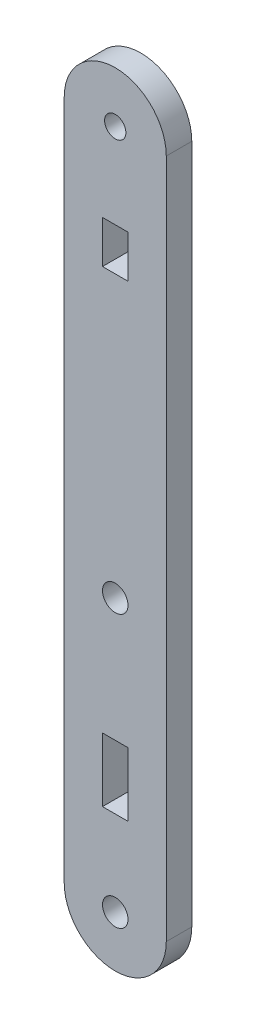
ISO-10303-21;
HEADER;
FILE_DESCRIPTION(('STEP AP214'),'2;1');
FILE_NAME('part.step','',(''),(''),'','','');
FILE_SCHEMA(('AUTOMOTIVE_DESIGN { 1 0 10303 214 1 1 1 1 }'));
ENDSEC;
DATA;
#1=APPLICATION_CONTEXT('core data for automotive mechanical design processes');
#2=APPLICATION_PROTOCOL_DEFINITION('international standard','automotive_design',2000,#1);
#3=PRODUCT_CONTEXT('',#1,'mechanical');
#4=PRODUCT('Part','Part','',(#3));
#5=PRODUCT_RELATED_PRODUCT_CATEGORY('part','',(#4));
#6=PRODUCT_DEFINITION_FORMATION('','',#4);
#7=PRODUCT_DEFINITION_CONTEXT('part definition',#1,'design');
#8=PRODUCT_DEFINITION('design','',#6,#7);
#9=PRODUCT_DEFINITION_SHAPE('','',#8);
#10=(LENGTH_UNIT() NAMED_UNIT(*) SI_UNIT(.MILLI.,.METRE.));
#11=(NAMED_UNIT(*) PLANE_ANGLE_UNIT() SI_UNIT($,.RADIAN.));
#12=(NAMED_UNIT(*) SI_UNIT($,.STERADIAN.) SOLID_ANGLE_UNIT());
#13=UNCERTAINTY_MEASURE_WITH_UNIT(LENGTH_MEASURE(1.E-05),#10,'distance_accuracy_value','');
#14=(GEOMETRIC_REPRESENTATION_CONTEXT(3) GLOBAL_UNCERTAINTY_ASSIGNED_CONTEXT((#13)) GLOBAL_UNIT_ASSIGNED_CONTEXT((#10,
#11,#12)) REPRESENTATION_CONTEXT('',''));
#15=CARTESIAN_POINT('',(0.,0.,0.));
#16=DIRECTION('',(0.,0.,1.));
#17=DIRECTION('',(1.,0.,0.));
#18=AXIS2_PLACEMENT_3D('',#15,#16,#17);
#19=CARTESIAN_POINT('',(2176.74034545701,1499.10024083383,3.));
#20=DIRECTION('',(0.,0.,1.));
#21=DIRECTION('',(1.,0.,0.));
#22=AXIS2_PLACEMENT_3D('',#19,#20,#21);
#23=PLANE('',#22);
#24=CARTESIAN_POINT('',(2176.74350350772,1499.10717013721,3.));
#25=DIRECTION('',(0.,0.,1.));
#26=DIRECTION('',(1.,0.,0.));
#27=AXIS2_PLACEMENT_3D('',#24,#25,#26);
#28=CIRCLE('',#27,1.50000000000011);
#29=CARTESIAN_POINT('',(2178.24350350772,1499.10717013721,3.));
#30=VERTEX_POINT('',#29);
#31=EDGE_CURVE('E169',#30,#30,#28,.T.);
#32=ORIENTED_EDGE('',*,*,#31,.F.);
#33=EDGE_LOOP('',(#32));
#34=FACE_BOUND('',#33,.T.);
#35=DIRECTION('',(0.,1.,0.));
#36=VECTOR('',#35,1.);
#37=CARTESIAN_POINT('',(2178.24034545616,1564.10018841039,3.));
#38=LINE('',#37,#36);
#39=CARTESIAN_POINT('',(2178.24034545616,1564.10018841039,3.));
#40=VERTEX_POINT('',#39);
#41=CARTESIAN_POINT('',(2178.24034545616,1569.10018841039,3.));
#42=VERTEX_POINT('',#41);
#43=EDGE_CURVE('E183',#40,#42,#38,.T.);
#44=ORIENTED_EDGE('',*,*,#43,.F.);
#45=DIRECTION('',(1.,0.,0.));
#46=VECTOR('',#45,1.);
#47=CARTESIAN_POINT('',(2175.24034545616,1564.10018841039,3.));
#48=LINE('',#47,#46);
#49=CARTESIAN_POINT('',(2175.24034545616,1564.10018841039,3.));
#50=VERTEX_POINT('',#49);
#51=EDGE_CURVE('E181',#50,#40,#48,.T.);
#52=ORIENTED_EDGE('',*,*,#51,.F.);
#53=DIRECTION('',(0.,-1.,0.));
#54=VECTOR('',#53,1.);
#55=CARTESIAN_POINT('',(2175.24034545616,1569.10018841039,3.));
#56=LINE('',#55,#54);
#57=CARTESIAN_POINT('',(2175.24034545616,1569.10018841039,3.));
#58=VERTEX_POINT('',#57);
#59=EDGE_CURVE('E189',#58,#50,#56,.T.);
#60=ORIENTED_EDGE('',*,*,#59,.F.);
#61=DIRECTION('',(-1.,0.,0.));
#62=VECTOR('',#61,1.);
#63=CARTESIAN_POINT('',(2178.24034545616,1569.10018841039,3.));
#64=LINE('',#63,#62);
#65=EDGE_CURVE('E186',#42,#58,#64,.T.);
#66=ORIENTED_EDGE('',*,*,#65,.F.);
#67=EDGE_LOOP('',(#44,#52,#60,#66));
#68=FACE_BOUND('',#67,.T.);
#69=DIRECTION('',(0.,1.,0.));
#70=VECTOR('',#69,1.);
#71=CARTESIAN_POINT('',(2182.74034545616,1561.71130395543,3.));
#72=LINE('',#71,#70);
#73=CARTESIAN_POINT('',(2182.74034545616,1499.1000884104,3.));
#74=VERTEX_POINT('',#73);
#75=CARTESIAN_POINT('',(2182.74034545624,1579.10018841039,3.));
#76=VERTEX_POINT('',#75);
#77=EDGE_CURVE('E212',#74,#76,#72,.T.);
#78=ORIENTED_EDGE('',*,*,#77,.T.);
#79=CARTESIAN_POINT('',(2176.74034545424,1579.10018840847,3.));
#80=DIRECTION('',(0.,0.,1.));
#81=DIRECTION('',(1.,0.,0.));
#82=AXIS2_PLACEMENT_3D('',#79,#80,#81);
#83=CIRCLE('',#82,6.00000000200004);
#84=CARTESIAN_POINT('',(2170.74034545432,1579.10018841039,3.));
#85=VERTEX_POINT('',#84);
#86=EDGE_CURVE('E214',#76,#85,#83,.T.);
#87=ORIENTED_EDGE('',*,*,#86,.T.);
#88=DIRECTION('',(1.91512819173638E-10,-1.,0.));
#89=VECTOR('',#88,1.);
#90=CARTESIAN_POINT('',(2170.74034545616,1569.49551800172,3.));
#91=LINE('',#90,#89);
#92=CARTESIAN_POINT('',(2170.74034545616,1499.10018841024,3.));
#93=VERTEX_POINT('',#92);
#94=EDGE_CURVE('E217',#85,#93,#91,.T.);
#95=ORIENTED_EDGE('',*,*,#94,.T.);
#96=CARTESIAN_POINT('',(2176.74034545701,1499.10024083383,3.));
#97=DIRECTION('',(0.,0.,1.));
#98=DIRECTION('',(1.,0.,0.));
#99=AXIS2_PLACEMENT_3D('',#96,#97,#98);
#100=CIRCLE('',#99,6.00000000108255);
#101=EDGE_CURVE('E219',#93,#74,#100,.T.);
#102=ORIENTED_EDGE('',*,*,#101,.T.);
#103=EDGE_LOOP('',(#78,#87,#95,#102));
#104=FACE_BOUND('',#103,.T.);
#105=CARTESIAN_POINT('',(2176.74034545616,1531.10008841039,3.));
#106=DIRECTION('',(0.,0.,1.));
#107=DIRECTION('',(1.,0.,0.));
#108=AXIS2_PLACEMENT_3D('',#105,#106,#107);
#109=CIRCLE('',#108,1.50000000000011);
#110=CARTESIAN_POINT('',(2178.24034545616,1531.10008841039,3.));
#111=VERTEX_POINT('',#110);
#112=EDGE_CURVE('E175',#111,#111,#109,.T.);
#113=ORIENTED_EDGE('',*,*,#112,.F.);
#114=EDGE_LOOP('',(#113));
#115=FACE_BOUND('',#114,.T.);
#116=CARTESIAN_POINT('',(2176.74034545424,1579.10018840847,3.));
#117=DIRECTION('',(0.,0.,1.));
#118=DIRECTION('',(1.,0.,0.));
#119=AXIS2_PLACEMENT_3D('',#116,#117,#118);
#120=CIRCLE('',#119,1.25000000000008);
#121=CARTESIAN_POINT('',(2177.99034545424,1579.10018840847,3.));
#122=VERTEX_POINT('',#121);
#123=EDGE_CURVE('E163',#122,#122,#120,.T.);
#124=ORIENTED_EDGE('',*,*,#123,.F.);
#125=EDGE_LOOP('',(#124));
#126=FACE_BOUND('',#125,.T.);
#127=DIRECTION('',(-1.,0.,0.));
#128=VECTOR('',#127,1.);
#129=CARTESIAN_POINT('',(2178.24034545616,1516.60018841039,3.));
#130=LINE('',#129,#128);
#131=CARTESIAN_POINT('',(2178.24034545616,1516.60018841039,3.));
#132=VERTEX_POINT('',#131);
#133=CARTESIAN_POINT('',(2175.24034545616,1516.60018841039,3.));
#134=VERTEX_POINT('',#133);
#135=EDGE_CURVE('E135',#132,#134,#130,.T.);
#136=ORIENTED_EDGE('',*,*,#135,.F.);
#137=DIRECTION('',(0.,1.,0.));
#138=VECTOR('',#137,1.);
#139=CARTESIAN_POINT('',(2178.24034545616,1509.10018841039,3.));
#140=LINE('',#139,#138);
#141=CARTESIAN_POINT('',(2178.24034545616,1509.10018841039,3.));
#142=VERTEX_POINT('',#141);
#143=EDGE_CURVE('E127',#142,#132,#140,.T.);
#144=ORIENTED_EDGE('',*,*,#143,.F.);
#145=DIRECTION('',(1.,0.,0.));
#146=VECTOR('',#145,1.);
#147=CARTESIAN_POINT('',(2175.24034545616,1509.10018841039,3.));
#148=LINE('',#147,#146);
#149=CARTESIAN_POINT('',(2175.24034545616,1509.10018841039,3.));
#150=VERTEX_POINT('',#149);
#151=EDGE_CURVE('E149',#150,#142,#148,.T.);
#152=ORIENTED_EDGE('',*,*,#151,.F.);
#153=DIRECTION('',(0.,-1.,0.));
#154=VECTOR('',#153,1.);
#155=CARTESIAN_POINT('',(2175.24034545616,1516.60018841039,3.));
#156=LINE('',#155,#154);
#157=EDGE_CURVE('E147',#134,#150,#156,.T.);
#158=ORIENTED_EDGE('',*,*,#157,.F.);
#159=EDGE_LOOP('',(#136,#144,#152,#158));
#160=FACE_BOUND('',#159,.T.);
#161=ADVANCED_FACE('F38',(#34,#68,#104,#115,#126,#160),#23,.T.);
#162=CARTESIAN_POINT('',(2176.74034545701,1499.10024083383,0.));
#163=DIRECTION('',(0.,0.,1.));
#164=DIRECTION('',(1.,0.,0.));
#165=AXIS2_PLACEMENT_3D('',#162,#163,#164);
#166=PLANE('',#165);
#167=CARTESIAN_POINT('',(2176.74034545424,1579.10018840847,0.));
#168=DIRECTION('',(0.,0.,1.));
#169=DIRECTION('',(1.,0.,0.));
#170=AXIS2_PLACEMENT_3D('',#167,#168,#169);
#171=CIRCLE('',#170,1.25000000000008);
#172=CARTESIAN_POINT('',(2177.99034545424,1579.10018840847,0.));
#173=VERTEX_POINT('',#172);
#174=EDGE_CURVE('E143',#173,#173,#171,.T.);
#175=ORIENTED_EDGE('',*,*,#174,.T.);
#176=EDGE_LOOP('',(#175));
#177=FACE_BOUND('',#176,.T.);
#178=CARTESIAN_POINT('',(2176.74350350772,1499.10717013721,0.));
#179=DIRECTION('',(0.,0.,1.));
#180=DIRECTION('',(1.,0.,0.));
#181=AXIS2_PLACEMENT_3D('',#178,#179,#180);
#182=CIRCLE('',#181,1.50000000000011);
#183=CARTESIAN_POINT('',(2178.24350350772,1499.10717013721,0.));
#184=VERTEX_POINT('',#183);
#185=EDGE_CURVE('E166',#184,#184,#182,.T.);
#186=ORIENTED_EDGE('',*,*,#185,.T.);
#187=EDGE_LOOP('',(#186));
#188=FACE_BOUND('',#187,.T.);
#189=CARTESIAN_POINT('',(2176.74034545616,1531.10008841039,0.));
#190=DIRECTION('',(0.,0.,1.));
#191=DIRECTION('',(1.,0.,0.));
#192=AXIS2_PLACEMENT_3D('',#189,#190,#191);
#193=CIRCLE('',#192,1.50000000000011);
#194=CARTESIAN_POINT('',(2178.24034545616,1531.10008841039,0.));
#195=VERTEX_POINT('',#194);
#196=EDGE_CURVE('E172',#195,#195,#193,.T.);
#197=ORIENTED_EDGE('',*,*,#196,.T.);
#198=EDGE_LOOP('',(#197));
#199=FACE_BOUND('',#198,.T.);
#200=DIRECTION('',(1.,0.,0.));
#201=VECTOR('',#200,1.);
#202=CARTESIAN_POINT('',(2175.24034545616,1564.10018841039,0.));
#203=LINE('',#202,#201);
#204=CARTESIAN_POINT('',(2175.24034545616,1564.10018841039,0.));
#205=VERTEX_POINT('',#204);
#206=CARTESIAN_POINT('',(2178.24034545616,1564.10018841039,0.));
#207=VERTEX_POINT('',#206);
#208=EDGE_CURVE('E178',#205,#207,#203,.T.);
#209=ORIENTED_EDGE('',*,*,#208,.T.);
#210=DIRECTION('',(0.,1.,0.));
#211=VECTOR('',#210,1.);
#212=CARTESIAN_POINT('',(2178.24034545616,1564.10018841039,0.));
#213=LINE('',#212,#211);
#214=CARTESIAN_POINT('',(2178.24034545616,1569.10018841039,0.));
#215=VERTEX_POINT('',#214);
#216=EDGE_CURVE('E194',#207,#215,#213,.T.);
#217=ORIENTED_EDGE('',*,*,#216,.T.);
#218=DIRECTION('',(-1.,0.,0.));
#219=VECTOR('',#218,1.);
#220=CARTESIAN_POINT('',(2178.24034545616,1569.10018841039,0.));
#221=LINE('',#220,#219);
#222=CARTESIAN_POINT('',(2175.24034545616,1569.10018841039,0.));
#223=VERTEX_POINT('',#222);
#224=EDGE_CURVE('E197',#215,#223,#221,.T.);
#225=ORIENTED_EDGE('',*,*,#224,.T.);
#226=DIRECTION('',(0.,-1.,0.));
#227=VECTOR('',#226,1.);
#228=CARTESIAN_POINT('',(2175.24034545616,1569.10018841039,0.));
#229=LINE('',#228,#227);
#230=EDGE_CURVE('E184',#223,#205,#229,.T.);
#231=ORIENTED_EDGE('',*,*,#230,.T.);
#232=EDGE_LOOP('',(#209,#217,#225,#231));
#233=FACE_BOUND('',#232,.T.);
#234=CARTESIAN_POINT('',(2176.74034545424,1579.10018840847,0.));
#235=DIRECTION('',(0.,0.,1.));
#236=DIRECTION('',(1.,0.,0.));
#237=AXIS2_PLACEMENT_3D('',#234,#235,#236);
#238=CIRCLE('',#237,5.99999999991625);
#239=CARTESIAN_POINT('',(2182.74034545624,1579.10018841039,0.));
#240=VERTEX_POINT('',#239);
#241=CARTESIAN_POINT('',(2170.74034545432,1579.10018841039,0.));
#242=VERTEX_POINT('',#241);
#243=EDGE_CURVE('E211',#240,#242,#238,.T.);
#244=ORIENTED_EDGE('',*,*,#243,.F.);
#245=DIRECTION('',(0.,1.,0.));
#246=VECTOR('',#245,1.);
#247=CARTESIAN_POINT('',(2182.74034545616,1542.32251950048,0.));
#248=LINE('',#247,#246);
#249=CARTESIAN_POINT('',(2182.74034545616,1499.1000884104,0.));
#250=VERTEX_POINT('',#249);
#251=EDGE_CURVE('E215',#250,#240,#248,.T.);
#252=ORIENTED_EDGE('',*,*,#251,.F.);
#253=CARTESIAN_POINT('',(2176.74034545701,1499.10024083383,0.));
#254=DIRECTION('',(0.,0.,1.));
#255=DIRECTION('',(1.,0.,0.));
#256=AXIS2_PLACEMENT_3D('',#253,#254,#255);
#257=CIRCLE('',#256,6.00000000108255);
#258=CARTESIAN_POINT('',(2170.74034545616,1499.10018841024,0.));
#259=VERTEX_POINT('',#258);
#260=EDGE_CURVE('E227',#259,#250,#257,.T.);
#261=ORIENTED_EDGE('',*,*,#260,.F.);
#262=DIRECTION('',(3.41665944563554E-13,-1.,0.));
#263=VECTOR('',#262,1.);
#264=CARTESIAN_POINT('',(2170.74034545616,1499.10018841024,0.));
#265=LINE('',#264,#263);
#266=EDGE_CURVE('E225',#242,#259,#265,.T.);
#267=ORIENTED_EDGE('',*,*,#266,.F.);
#268=EDGE_LOOP('',(#244,#252,#261,#267));
#269=FACE_BOUND('',#268,.T.);
#270=DIRECTION('',(0.,1.,0.));
#271=VECTOR('',#270,1.);
#272=CARTESIAN_POINT('',(2178.24034545616,1509.10018841039,0.));
#273=LINE('',#272,#271);
#274=CARTESIAN_POINT('',(2178.24034545616,1509.10018841039,0.));
#275=VERTEX_POINT('',#274);
#276=CARTESIAN_POINT('',(2178.24034545616,1516.60018841039,0.));
#277=VERTEX_POINT('',#276);
#278=EDGE_CURVE('E61',#275,#277,#273,.T.);
#279=ORIENTED_EDGE('',*,*,#278,.T.);
#280=DIRECTION('',(-1.,0.,0.));
#281=VECTOR('',#280,1.);
#282=CARTESIAN_POINT('',(2178.24034545616,1516.60018841039,0.));
#283=LINE('',#282,#281);
#284=CARTESIAN_POINT('',(2175.24034545616,1516.60018841039,0.));
#285=VERTEX_POINT('',#284);
#286=EDGE_CURVE('E142',#277,#285,#283,.T.);
#287=ORIENTED_EDGE('',*,*,#286,.T.);
#288=DIRECTION('',(0.,-1.,0.));
#289=VECTOR('',#288,1.);
#290=CARTESIAN_POINT('',(2175.24034545616,1516.60018841039,0.));
#291=LINE('',#290,#289);
#292=CARTESIAN_POINT('',(2175.24034545616,1509.10018841039,0.));
#293=VERTEX_POINT('',#292);
#294=EDGE_CURVE('E155',#285,#293,#291,.T.);
#295=ORIENTED_EDGE('',*,*,#294,.T.);
#296=DIRECTION('',(1.,0.,0.));
#297=VECTOR('',#296,1.);
#298=CARTESIAN_POINT('',(2175.24034545616,1509.10018841039,0.));
#299=LINE('',#298,#297);
#300=EDGE_CURVE('E136',#293,#275,#299,.T.);
#301=ORIENTED_EDGE('',*,*,#300,.T.);
#302=EDGE_LOOP('',(#279,#287,#295,#301));
#303=FACE_BOUND('',#302,.T.);
#304=ADVANCED_FACE('F246',(#177,#188,#199,#233,#269,#303),#166,.F.);
#305=CARTESIAN_POINT('',(2176.74034545424,1579.10018840847,3.));
#306=DIRECTION('',(0.,0.,-1.));
#307=DIRECTION('',(-1.,0.,0.));
#308=AXIS2_PLACEMENT_3D('',#305,#306,#307);
#309=CYLINDRICAL_SURFACE('',#308,5.99999999991625);
#310=ORIENTED_EDGE('',*,*,#243,.T.);
#311=DIRECTION('',(0.,0.,-1.));
#312=VECTOR('',#311,1.);
#313=CARTESIAN_POINT('',(2170.74034545432,1579.10018841039,3.));
#314=LINE('',#313,#312);
#315=EDGE_CURVE('E46',#85,#242,#314,.T.);
#316=ORIENTED_EDGE('',*,*,#315,.F.);
#317=ORIENTED_EDGE('',*,*,#86,.F.);
#318=DIRECTION('',(0.,0.,-1.));
#319=VECTOR('',#318,1.);
#320=CARTESIAN_POINT('',(2182.74034545624,1579.10018841039,3.));
#321=LINE('',#320,#319);
#322=EDGE_CURVE('E11',#76,#240,#321,.T.);
#323=ORIENTED_EDGE('',*,*,#322,.T.);
#324=EDGE_LOOP('',(#310,#316,#317,#323));
#325=FACE_BOUND('',#324,.T.);
#326=ADVANCED_FACE('F40',(#325),#309,.T.);
#327=CARTESIAN_POINT('',(2170.74034545616,1499.10018841024,3.));
#328=DIRECTION('',(1.,3.41665944563554E-13,0.));
#329=DIRECTION('',(-3.41665944563554E-13,1.,0.));
#330=AXIS2_PLACEMENT_3D('',#327,#328,#329);
#331=PLANE('',#330);
#332=ORIENTED_EDGE('',*,*,#266,.T.);
#333=DIRECTION('',(0.,0.,-1.));
#334=VECTOR('',#333,1.);
#335=CARTESIAN_POINT('',(2170.74034545616,1499.10018841024,3.));
#336=LINE('',#335,#334);
#337=EDGE_CURVE('E233',#93,#259,#336,.T.);
#338=ORIENTED_EDGE('',*,*,#337,.F.);
#339=ORIENTED_EDGE('',*,*,#94,.F.);
#340=ORIENTED_EDGE('',*,*,#315,.T.);
#341=EDGE_LOOP('',(#332,#338,#339,#340));
#342=FACE_BOUND('',#341,.T.);
#343=ADVANCED_FACE('F239',(#342),#331,.F.);
#344=CARTESIAN_POINT('',(2176.74034545701,1499.10024083383,3.));
#345=DIRECTION('',(0.,0.,-1.));
#346=DIRECTION('',(-1.,0.,0.));
#347=AXIS2_PLACEMENT_3D('',#344,#345,#346);
#348=CYLINDRICAL_SURFACE('',#347,6.00000000108255);
#349=ORIENTED_EDGE('',*,*,#260,.T.);
#350=DIRECTION('',(0.,0.,-1.));
#351=VECTOR('',#350,1.);
#352=CARTESIAN_POINT('',(2182.74034545616,1499.1000884104,3.));
#353=LINE('',#352,#351);
#354=EDGE_CURVE('E222',#74,#250,#353,.T.);
#355=ORIENTED_EDGE('',*,*,#354,.F.);
#356=ORIENTED_EDGE('',*,*,#101,.F.);
#357=ORIENTED_EDGE('',*,*,#337,.T.);
#358=EDGE_LOOP('',(#349,#355,#356,#357));
#359=FACE_BOUND('',#358,.T.);
#360=ADVANCED_FACE('F251',(#359),#348,.T.);
#361=CARTESIAN_POINT('',(2182.74034545616,1542.32251950048,3.));
#362=DIRECTION('',(-1.,0.,0.));
#363=DIRECTION('',(0.,0.,1.));
#364=AXIS2_PLACEMENT_3D('',#361,#362,#363);
#365=PLANE('',#364);
#366=ORIENTED_EDGE('',*,*,#251,.T.);
#367=ORIENTED_EDGE('',*,*,#322,.F.);
#368=ORIENTED_EDGE('',*,*,#77,.F.);
#369=ORIENTED_EDGE('',*,*,#354,.T.);
#370=EDGE_LOOP('',(#366,#367,#368,#369));
#371=FACE_BOUND('',#370,.T.);
#372=ADVANCED_FACE('F254',(#371),#365,.F.);
#373=CARTESIAN_POINT('',(2175.24034545616,1564.10018841039,3.));
#374=DIRECTION('',(0.,1.,0.));
#375=DIRECTION('',(0.,0.,1.));
#376=AXIS2_PLACEMENT_3D('',#373,#374,#375);
#377=PLANE('',#376);
#378=ORIENTED_EDGE('',*,*,#208,.F.);
#379=DIRECTION('',(0.,0.,-1.));
#380=VECTOR('',#379,1.);
#381=CARTESIAN_POINT('',(2175.24034545616,1564.10018841039,3.));
#382=LINE('',#381,#380);
#383=EDGE_CURVE('E191',#50,#205,#382,.T.);
#384=ORIENTED_EDGE('',*,*,#383,.F.);
#385=ORIENTED_EDGE('',*,*,#51,.T.);
#386=DIRECTION('',(0.,0.,-1.));
#387=VECTOR('',#386,1.);
#388=CARTESIAN_POINT('',(2178.24034545616,1564.10018841039,3.));
#389=LINE('',#388,#387);
#390=EDGE_CURVE('E208',#40,#207,#389,.T.);
#391=ORIENTED_EDGE('',*,*,#390,.T.);
#392=EDGE_LOOP('',(#378,#384,#385,#391));
#393=FACE_BOUND('',#392,.T.);
#394=ADVANCED_FACE('F281',(#393),#377,.T.);
#395=CARTESIAN_POINT('',(2178.24034545616,1564.10018841039,3.));
#396=DIRECTION('',(-1.,0.,0.));
#397=DIRECTION('',(0.,0.,1.));
#398=AXIS2_PLACEMENT_3D('',#395,#396,#397);
#399=PLANE('',#398);
#400=ORIENTED_EDGE('',*,*,#216,.F.);
#401=ORIENTED_EDGE('',*,*,#390,.F.);
#402=ORIENTED_EDGE('',*,*,#43,.T.);
#403=DIRECTION('',(0.,0.,-1.));
#404=VECTOR('',#403,1.);
#405=CARTESIAN_POINT('',(2178.24034545616,1569.10018841039,3.));
#406=LINE('',#405,#404);
#407=EDGE_CURVE('E206',#42,#215,#406,.T.);
#408=ORIENTED_EDGE('',*,*,#407,.T.);
#409=EDGE_LOOP('',(#400,#401,#402,#408));
#410=FACE_BOUND('',#409,.T.);
#411=ADVANCED_FACE('F291',(#410),#399,.T.);
#412=CARTESIAN_POINT('',(2178.24034545616,1569.10018841039,3.));
#413=DIRECTION('',(0.,-1.,0.));
#414=DIRECTION('',(0.,0.,-1.));
#415=AXIS2_PLACEMENT_3D('',#412,#413,#414);
#416=PLANE('',#415);
#417=ORIENTED_EDGE('',*,*,#224,.F.);
#418=ORIENTED_EDGE('',*,*,#407,.F.);
#419=ORIENTED_EDGE('',*,*,#65,.T.);
#420=DIRECTION('',(0.,0.,-1.));
#421=VECTOR('',#420,1.);
#422=CARTESIAN_POINT('',(2175.24034545616,1569.10018841039,3.));
#423=LINE('',#422,#421);
#424=EDGE_CURVE('E204',#58,#223,#423,.T.);
#425=ORIENTED_EDGE('',*,*,#424,.T.);
#426=EDGE_LOOP('',(#417,#418,#419,#425));
#427=FACE_BOUND('',#426,.T.);
#428=ADVANCED_FACE('F295',(#427),#416,.T.);
#429=CARTESIAN_POINT('',(2175.24034545616,1569.10018841039,3.));
#430=DIRECTION('',(1.,0.,0.));
#431=DIRECTION('',(0.,0.,-1.));
#432=AXIS2_PLACEMENT_3D('',#429,#430,#431);
#433=PLANE('',#432);
#434=ORIENTED_EDGE('',*,*,#230,.F.);
#435=ORIENTED_EDGE('',*,*,#424,.F.);
#436=ORIENTED_EDGE('',*,*,#59,.T.);
#437=ORIENTED_EDGE('',*,*,#383,.T.);
#438=EDGE_LOOP('',(#434,#435,#436,#437));
#439=FACE_BOUND('',#438,.T.);
#440=ADVANCED_FACE('F285',(#439),#433,.T.);
#441=CARTESIAN_POINT('',(2176.74034545616,1531.10008841039,3.));
#442=DIRECTION('',(0.,0.,-1.));
#443=DIRECTION('',(-1.,0.,0.));
#444=AXIS2_PLACEMENT_3D('',#441,#442,#443);
#445=CYLINDRICAL_SURFACE('',#444,1.50000000000011);
#446=ORIENTED_EDGE('',*,*,#112,.T.);
#447=EDGE_LOOP('',(#446));
#448=FACE_BOUND('',#447,.T.);
#449=ORIENTED_EDGE('',*,*,#196,.F.);
#450=EDGE_LOOP('',(#449));
#451=FACE_BOUND('',#450,.T.);
#452=ADVANCED_FACE('F302',(#448,#451),#445,.F.);
#453=CARTESIAN_POINT('',(2176.74350350772,1499.10717013721,3.));
#454=DIRECTION('',(0.,0.,-1.));
#455=DIRECTION('',(-1.,0.,0.));
#456=AXIS2_PLACEMENT_3D('',#453,#454,#455);
#457=CYLINDRICAL_SURFACE('',#456,1.50000000000011);
#458=ORIENTED_EDGE('',*,*,#31,.T.);
#459=EDGE_LOOP('',(#458));
#460=FACE_BOUND('',#459,.T.);
#461=ORIENTED_EDGE('',*,*,#185,.F.);
#462=EDGE_LOOP('',(#461));
#463=FACE_BOUND('',#462,.T.);
#464=ADVANCED_FACE('F267',(#460,#463),#457,.F.);
#465=CARTESIAN_POINT('',(2176.74034545424,1579.10018840847,3.));
#466=DIRECTION('',(0.,0.,-1.));
#467=DIRECTION('',(-1.,0.,0.));
#468=AXIS2_PLACEMENT_3D('',#465,#466,#467);
#469=CYLINDRICAL_SURFACE('',#468,1.25000000000008);
#470=ORIENTED_EDGE('',*,*,#123,.T.);
#471=EDGE_LOOP('',(#470));
#472=FACE_BOUND('',#471,.T.);
#473=ORIENTED_EDGE('',*,*,#174,.F.);
#474=EDGE_LOOP('',(#473));
#475=FACE_BOUND('',#474,.T.);
#476=ADVANCED_FACE('F264',(#472,#475),#469,.F.);
#477=CARTESIAN_POINT('',(2178.24034545616,1509.10018841039,3.));
#478=DIRECTION('',(-1.,0.,0.));
#479=DIRECTION('',(0.,0.,1.));
#480=AXIS2_PLACEMENT_3D('',#477,#478,#479);
#481=PLANE('',#480);
#482=ORIENTED_EDGE('',*,*,#278,.F.);
#483=DIRECTION('',(0.,0.,-1.));
#484=VECTOR('',#483,1.);
#485=CARTESIAN_POINT('',(2178.24034545616,1509.10018841039,3.));
#486=LINE('',#485,#484);
#487=EDGE_CURVE('E131',#142,#275,#486,.T.);
#488=ORIENTED_EDGE('',*,*,#487,.F.);
#489=ORIENTED_EDGE('',*,*,#143,.T.);
#490=DIRECTION('',(0.,0.,-1.));
#491=VECTOR('',#490,1.);
#492=CARTESIAN_POINT('',(2178.24034545616,1516.60018841039,3.));
#493=LINE('',#492,#491);
#494=EDGE_CURVE('E130',#132,#277,#493,.T.);
#495=ORIENTED_EDGE('',*,*,#494,.T.);
#496=EDGE_LOOP('',(#482,#488,#489,#495));
#497=FACE_BOUND('',#496,.T.);
#498=ADVANCED_FACE('F129',(#497),#481,.T.);
#499=CARTESIAN_POINT('',(2178.24034545616,1516.60018841039,3.));
#500=DIRECTION('',(0.,-1.,0.));
#501=DIRECTION('',(0.,0.,-1.));
#502=AXIS2_PLACEMENT_3D('',#499,#500,#501);
#503=PLANE('',#502);
#504=ORIENTED_EDGE('',*,*,#286,.F.);
#505=ORIENTED_EDGE('',*,*,#494,.F.);
#506=ORIENTED_EDGE('',*,*,#135,.T.);
#507=DIRECTION('',(0.,0.,-1.));
#508=VECTOR('',#507,1.);
#509=CARTESIAN_POINT('',(2175.24034545616,1516.60018841039,3.));
#510=LINE('',#509,#508);
#511=EDGE_CURVE('E144',#134,#285,#510,.T.);
#512=ORIENTED_EDGE('',*,*,#511,.T.);
#513=EDGE_LOOP('',(#504,#505,#506,#512));
#514=FACE_BOUND('',#513,.T.);
#515=ADVANCED_FACE('F139',(#514),#503,.T.);
#516=CARTESIAN_POINT('',(2175.24034545616,1516.60018841039,3.));
#517=DIRECTION('',(1.,0.,0.));
#518=DIRECTION('',(0.,0.,-1.));
#519=AXIS2_PLACEMENT_3D('',#516,#517,#518);
#520=PLANE('',#519);
#521=ORIENTED_EDGE('',*,*,#294,.F.);
#522=ORIENTED_EDGE('',*,*,#511,.F.);
#523=ORIENTED_EDGE('',*,*,#157,.T.);
#524=DIRECTION('',(0.,0.,-1.));
#525=VECTOR('',#524,1.);
#526=CARTESIAN_POINT('',(2175.24034545616,1509.10018841039,3.));
#527=LINE('',#526,#525);
#528=EDGE_CURVE('E53',#150,#293,#527,.T.);
#529=ORIENTED_EDGE('',*,*,#528,.T.);
#530=EDGE_LOOP('',(#521,#522,#523,#529));
#531=FACE_BOUND('',#530,.T.);
#532=ADVANCED_FACE('F445',(#531),#520,.T.);
#533=CARTESIAN_POINT('',(2175.24034545616,1509.10018841039,3.));
#534=DIRECTION('',(0.,1.,0.));
#535=DIRECTION('',(0.,0.,1.));
#536=AXIS2_PLACEMENT_3D('',#533,#534,#535);
#537=PLANE('',#536);
#538=ORIENTED_EDGE('',*,*,#300,.F.);
#539=ORIENTED_EDGE('',*,*,#528,.F.);
#540=ORIENTED_EDGE('',*,*,#151,.T.);
#541=ORIENTED_EDGE('',*,*,#487,.T.);
#542=EDGE_LOOP('',(#538,#539,#540,#541));
#543=FACE_BOUND('',#542,.T.);
#544=ADVANCED_FACE('F453',(#543),#537,.T.);
#545=CLOSED_SHELL('',(#161,#304,#326,#343,#360,#372,#394,#411,#428,#440,#452,#464,#476,#498,
#515,#532,#544));
#546=MANIFOLD_SOLID_BREP('B2',#545);
#547=ADVANCED_BREP_SHAPE_REPRESENTATION('',(#18,#546),#14);
#548=SHAPE_DEFINITION_REPRESENTATION(#9,#547);
ENDSEC;
END-ISO-10303-21;
